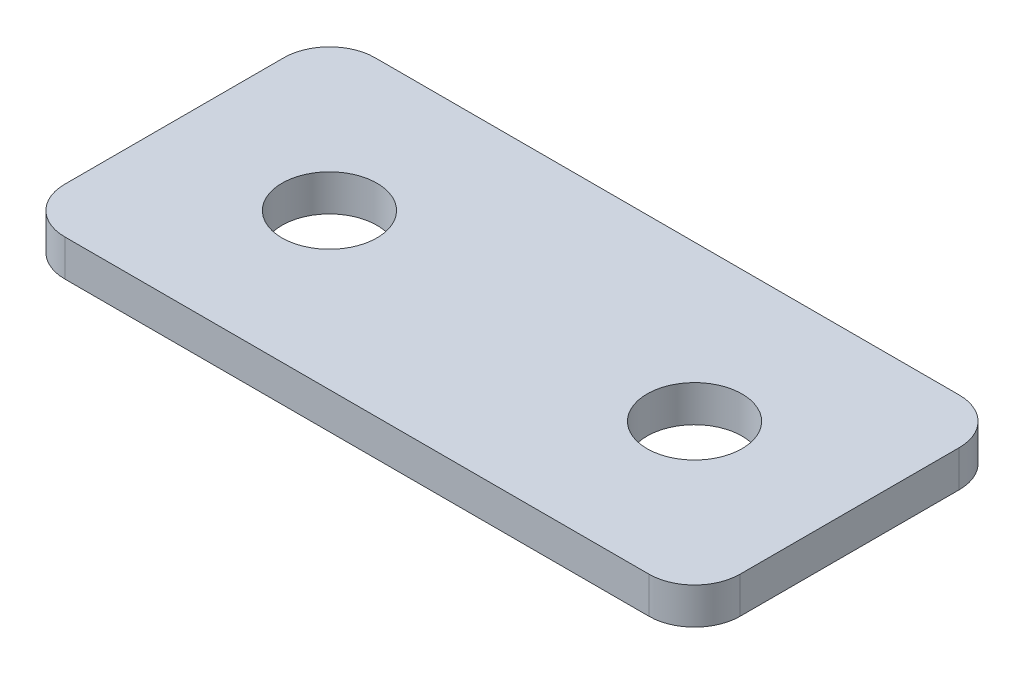
ISO-10303-21;
HEADER;
FILE_DESCRIPTION(('STEP AP214'),'2;1');
FILE_NAME('part.step','',(''),(''),'','','');
FILE_SCHEMA(('AUTOMOTIVE_DESIGN { 1 0 10303 214 1 1 1 1 }'));
ENDSEC;
DATA;
#1=APPLICATION_CONTEXT('core data for automotive mechanical design processes');
#2=APPLICATION_PROTOCOL_DEFINITION('international standard','automotive_design',2000,#1);
#3=PRODUCT_CONTEXT('',#1,'mechanical');
#4=PRODUCT('Part','Part','',(#3));
#5=PRODUCT_RELATED_PRODUCT_CATEGORY('part','',(#4));
#6=PRODUCT_DEFINITION_FORMATION('','',#4);
#7=PRODUCT_DEFINITION_CONTEXT('part definition',#1,'design');
#8=PRODUCT_DEFINITION('design','',#6,#7);
#9=PRODUCT_DEFINITION_SHAPE('','',#8);
#10=(LENGTH_UNIT() NAMED_UNIT(*) SI_UNIT(.MILLI.,.METRE.));
#11=(NAMED_UNIT(*) PLANE_ANGLE_UNIT() SI_UNIT($,.RADIAN.));
#12=(NAMED_UNIT(*) SI_UNIT($,.STERADIAN.) SOLID_ANGLE_UNIT());
#13=UNCERTAINTY_MEASURE_WITH_UNIT(LENGTH_MEASURE(1.E-05),#10,'distance_accuracy_value','');
#14=(GEOMETRIC_REPRESENTATION_CONTEXT(3) GLOBAL_UNCERTAINTY_ASSIGNED_CONTEXT((#13)) GLOBAL_UNIT_ASSIGNED_CONTEXT((#10,
#11,#12)) REPRESENTATION_CONTEXT('',''));
#15=CARTESIAN_POINT('',(0.,0.,0.));
#16=DIRECTION('',(0.,0.,1.));
#17=DIRECTION('',(1.,0.,0.));
#18=AXIS2_PLACEMENT_3D('',#15,#16,#17);
#19=CARTESIAN_POINT('',(-11.8867202723526,2.5745432277281,-1.68724203916781));
#20=DIRECTION('',(0.,-1.,0.));
#21=DIRECTION('',(0.,0.,-1.));
#22=AXIS2_PLACEMENT_3D('',#19,#20,#21);
#23=PLANE('',#22);
#24=CARTESIAN_POINT('',(8.11327972764736,2.5745432277281,-1.6872420391678));
#25=DIRECTION('',(0.,1.,0.));
#26=DIRECTION('',(0.,0.,1.));
#27=AXIS2_PLACEMENT_3D('',#24,#25,#26);
#28=CIRCLE('',#27,2.6);
#29=CARTESIAN_POINT('',(8.11327972764736,2.5745432277281,0.912757960832198));
#30=VERTEX_POINT('',#29);
#31=EDGE_CURVE('E157',#30,#30,#28,.T.);
#32=ORIENTED_EDGE('',*,*,#31,.T.);
#33=EDGE_LOOP('',(#32));
#34=FACE_BOUND('',#33,.T.);
#35=CARTESIAN_POINT('',(-11.8867202723526,2.5745432277281,-1.68724203916781));
#36=DIRECTION('',(0.,1.,0.));
#37=DIRECTION('',(0.,0.,1.));
#38=AXIS2_PLACEMENT_3D('',#35,#36,#37);
#39=CIRCLE('',#38,2.6);
#40=CARTESIAN_POINT('',(-11.8867202723526,2.5745432277281,0.912757960832188));
#41=VERTEX_POINT('',#40);
#42=EDGE_CURVE('E103',#41,#41,#39,.T.);
#43=ORIENTED_EDGE('',*,*,#42,.T.);
#44=EDGE_LOOP('',(#43));
#45=FACE_BOUND('',#44,.T.);
#46=DIRECTION('',(0.,0.,-1.));
#47=VECTOR('',#46,1.);
#48=CARTESIAN_POINT('',(16.6132797276473,2.5745432277281,6.81275796083223));
#49=LINE('',#48,#47);
#50=CARTESIAN_POINT('',(16.6132797276473,2.5745432277281,4.31275796083222));
#51=VERTEX_POINT('',#50);
#52=CARTESIAN_POINT('',(16.6132797276473,2.5745432277281,-7.68724203916785));
#53=VERTEX_POINT('',#52);
#54=EDGE_CURVE('E150',#51,#53,#49,.T.);
#55=ORIENTED_EDGE('',*,*,#54,.F.);
#56=CARTESIAN_POINT('',(14.1132797276473,2.5745432277281,4.31275796083222));
#57=DIRECTION('',(0.,-1.,0.));
#58=DIRECTION('',(0.,0.,-1.));
#59=AXIS2_PLACEMENT_3D('',#56,#57,#58);
#60=CIRCLE('',#59,2.5);
#61=CARTESIAN_POINT('',(14.1132797276473,2.5745432277281,6.81275796083223));
#62=VERTEX_POINT('',#61);
#63=EDGE_CURVE('E130',#51,#62,#60,.T.);
#64=ORIENTED_EDGE('',*,*,#63,.T.);
#65=DIRECTION('',(1.,0.,0.));
#66=VECTOR('',#65,1.);
#67=CARTESIAN_POINT('',(-3.38672027235258,2.5745432277281,6.81275796083223));
#68=LINE('',#67,#66);
#69=CARTESIAN_POINT('',(-17.8867202723527,2.5745432277281,6.81275796083223));
#70=VERTEX_POINT('',#69);
#71=EDGE_CURVE('E146',#70,#62,#68,.T.);
#72=ORIENTED_EDGE('',*,*,#71,.F.);
#73=CARTESIAN_POINT('',(-17.8867202723527,2.5745432277281,4.31275796083222));
#74=DIRECTION('',(0.,-1.,0.));
#75=DIRECTION('',(0.,0.,-1.));
#76=AXIS2_PLACEMENT_3D('',#73,#74,#75);
#77=CIRCLE('',#76,2.5);
#78=CARTESIAN_POINT('',(-20.3867202723527,2.5745432277281,4.31275796083222));
#79=VERTEX_POINT('',#78);
#80=EDGE_CURVE('E106',#70,#79,#77,.T.);
#81=ORIENTED_EDGE('',*,*,#80,.T.);
#82=DIRECTION('',(0.,0.,1.));
#83=VECTOR('',#82,1.);
#84=CARTESIAN_POINT('',(-20.3867202723527,2.5745432277281,-10.1872420391678));
#85=LINE('',#84,#83);
#86=CARTESIAN_POINT('',(-20.3867202723527,2.5745432277281,-7.68724203916785));
#87=VERTEX_POINT('',#86);
#88=EDGE_CURVE('E107',#87,#79,#85,.T.);
#89=ORIENTED_EDGE('',*,*,#88,.F.);
#90=CARTESIAN_POINT('',(-17.8867202723527,2.5745432277281,-7.68724203916785));
#91=DIRECTION('',(0.,-1.,0.));
#92=DIRECTION('',(0.,0.,-1.));
#93=AXIS2_PLACEMENT_3D('',#90,#91,#92);
#94=CIRCLE('',#93,2.5);
#95=CARTESIAN_POINT('',(-17.8867202723527,2.5745432277281,-10.1872420391678));
#96=VERTEX_POINT('',#95);
#97=EDGE_CURVE('E31',#87,#96,#94,.T.);
#98=ORIENTED_EDGE('',*,*,#97,.T.);
#99=DIRECTION('',(-1.,0.,0.));
#100=VECTOR('',#99,1.);
#101=CARTESIAN_POINT('',(16.6132797276473,2.5745432277281,-10.1872420391679));
#102=LINE('',#101,#100);
#103=CARTESIAN_POINT('',(14.1132797276473,2.5745432277281,-10.1872420391679));
#104=VERTEX_POINT('',#103);
#105=EDGE_CURVE('E111',#104,#96,#102,.T.);
#106=ORIENTED_EDGE('',*,*,#105,.F.);
#107=CARTESIAN_POINT('',(14.1132797276473,2.5745432277281,-7.68724203916785));
#108=DIRECTION('',(0.,-1.,0.));
#109=DIRECTION('',(0.,0.,-1.));
#110=AXIS2_PLACEMENT_3D('',#107,#108,#109);
#111=CIRCLE('',#110,2.5);
#112=EDGE_CURVE('E128',#104,#53,#111,.T.);
#113=ORIENTED_EDGE('',*,*,#112,.T.);
#114=EDGE_LOOP('',(#55,#64,#72,#81,#89,#98,#106,#113));
#115=FACE_BOUND('',#114,.T.);
#116=ADVANCED_FACE('F16',(#34,#45,#115),#23,.T.);
#117=CARTESIAN_POINT('',(-3.38672027235258,2.5745432277281,6.81275796083223));
#118=DIRECTION('',(0.,0.,1.));
#119=DIRECTION('',(1.,0.,0.));
#120=AXIS2_PLACEMENT_3D('',#117,#118,#119);
#121=PLANE('',#120);
#122=ORIENTED_EDGE('',*,*,#71,.T.);
#123=DIRECTION('',(0.,1.,0.));
#124=VECTOR('',#123,1.);
#125=CARTESIAN_POINT('',(14.1132797276473,2.5745432277281,6.81275796083223));
#126=LINE('',#125,#124);
#127=CARTESIAN_POINT('',(14.1132797276473,4.5745432277281,6.81275796083223));
#128=VERTEX_POINT('',#127);
#129=EDGE_CURVE('E93',#62,#128,#126,.T.);
#130=ORIENTED_EDGE('',*,*,#129,.T.);
#131=DIRECTION('',(1.,0.,0.));
#132=VECTOR('',#131,1.);
#133=CARTESIAN_POINT('',(-3.38672027235258,4.5745432277281,6.81275796083223));
#134=LINE('',#133,#132);
#135=CARTESIAN_POINT('',(-17.8867202723527,4.5745432277281,6.81275796083223));
#136=VERTEX_POINT('',#135);
#137=EDGE_CURVE('E85',#136,#128,#134,.T.);
#138=ORIENTED_EDGE('',*,*,#137,.F.);
#139=DIRECTION('',(0.,1.,0.));
#140=VECTOR('',#139,1.);
#141=CARTESIAN_POINT('',(-17.8867202723527,2.5745432277281,6.81275796083223));
#142=LINE('',#141,#140);
#143=EDGE_CURVE('E99',#136,#70,#142,.F.);
#144=ORIENTED_EDGE('',*,*,#143,.T.);
#145=EDGE_LOOP('',(#122,#130,#138,#144));
#146=FACE_BOUND('',#145,.T.);
#147=ADVANCED_FACE('F98',(#146),#121,.T.);
#148=CARTESIAN_POINT('',(-20.3867202723527,2.5745432277281,-10.1872420391678));
#149=DIRECTION('',(-1.,0.,0.));
#150=DIRECTION('',(0.,0.,1.));
#151=AXIS2_PLACEMENT_3D('',#148,#149,#150);
#152=PLANE('',#151);
#153=DIRECTION('',(0.,0.,1.));
#154=VECTOR('',#153,1.);
#155=CARTESIAN_POINT('',(-20.3867202723527,4.5745432277281,-10.1872420391678));
#156=LINE('',#155,#154);
#157=CARTESIAN_POINT('',(-20.3867202723527,4.5745432277281,-7.68724203916785));
#158=VERTEX_POINT('',#157);
#159=CARTESIAN_POINT('',(-20.3867202723527,4.5745432277281,4.31275796083222));
#160=VERTEX_POINT('',#159);
#161=EDGE_CURVE('E87',#158,#160,#156,.T.);
#162=ORIENTED_EDGE('',*,*,#161,.F.);
#163=DIRECTION('',(0.,1.,0.));
#164=VECTOR('',#163,1.);
#165=CARTESIAN_POINT('',(-20.3867202723527,2.5745432277281,-7.68724203916785));
#166=LINE('',#165,#164);
#167=EDGE_CURVE('E10',#158,#87,#166,.F.);
#168=ORIENTED_EDGE('',*,*,#167,.T.);
#169=ORIENTED_EDGE('',*,*,#88,.T.);
#170=DIRECTION('',(0.,1.,0.));
#171=VECTOR('',#170,1.);
#172=CARTESIAN_POINT('',(-20.3867202723527,2.5745432277281,4.31275796083222));
#173=LINE('',#172,#171);
#174=EDGE_CURVE('E24',#79,#160,#173,.T.);
#175=ORIENTED_EDGE('',*,*,#174,.T.);
#176=EDGE_LOOP('',(#162,#168,#169,#175));
#177=FACE_BOUND('',#176,.T.);
#178=ADVANCED_FACE('F136',(#177),#152,.T.);
#179=CARTESIAN_POINT('',(16.6132797276473,2.5745432277281,-10.1872420391679));
#180=DIRECTION('',(0.,0.,-1.));
#181=DIRECTION('',(-1.,0.,0.));
#182=AXIS2_PLACEMENT_3D('',#179,#180,#181);
#183=PLANE('',#182);
#184=DIRECTION('',(-1.,0.,0.));
#185=VECTOR('',#184,1.);
#186=CARTESIAN_POINT('',(16.6132797276473,4.5745432277281,-10.1872420391679));
#187=LINE('',#186,#185);
#188=CARTESIAN_POINT('',(14.1132797276473,4.5745432277281,-10.1872420391679));
#189=VERTEX_POINT('',#188);
#190=CARTESIAN_POINT('',(-17.8867202723527,4.5745432277281,-10.1872420391678));
#191=VERTEX_POINT('',#190);
#192=EDGE_CURVE('E144',#189,#191,#187,.T.);
#193=ORIENTED_EDGE('',*,*,#192,.F.);
#194=DIRECTION('',(0.,1.,0.));
#195=VECTOR('',#194,1.);
#196=CARTESIAN_POINT('',(14.1132797276473,2.5745432277281,-10.1872420391679));
#197=LINE('',#196,#195);
#198=EDGE_CURVE('E38',#189,#104,#197,.F.);
#199=ORIENTED_EDGE('',*,*,#198,.T.);
#200=ORIENTED_EDGE('',*,*,#105,.T.);
#201=DIRECTION('',(0.,1.,0.));
#202=VECTOR('',#201,1.);
#203=CARTESIAN_POINT('',(-17.8867202723527,2.5745432277281,-10.1872420391678));
#204=LINE('',#203,#202);
#205=EDGE_CURVE('E132',#96,#191,#204,.T.);
#206=ORIENTED_EDGE('',*,*,#205,.T.);
#207=EDGE_LOOP('',(#193,#199,#200,#206));
#208=FACE_BOUND('',#207,.T.);
#209=ADVANCED_FACE('F143',(#208),#183,.T.);
#210=CARTESIAN_POINT('',(16.6132797276473,2.5745432277281,6.81275796083223));
#211=DIRECTION('',(1.,0.,0.));
#212=DIRECTION('',(0.,0.,-1.));
#213=AXIS2_PLACEMENT_3D('',#210,#211,#212);
#214=PLANE('',#213);
#215=DIRECTION('',(0.,0.,-1.));
#216=VECTOR('',#215,1.);
#217=CARTESIAN_POINT('',(16.6132797276473,4.5745432277281,6.81275796083223));
#218=LINE('',#217,#216);
#219=CARTESIAN_POINT('',(16.6132797276473,4.5745432277281,4.31275796083222));
#220=VERTEX_POINT('',#219);
#221=CARTESIAN_POINT('',(16.6132797276473,4.5745432277281,-7.68724203916785));
#222=VERTEX_POINT('',#221);
#223=EDGE_CURVE('E102',#220,#222,#218,.T.);
#224=ORIENTED_EDGE('',*,*,#223,.F.);
#225=DIRECTION('',(0.,1.,0.));
#226=VECTOR('',#225,1.);
#227=CARTESIAN_POINT('',(16.6132797276473,2.5745432277281,4.31275796083222));
#228=LINE('',#227,#226);
#229=EDGE_CURVE('E124',#220,#51,#228,.F.);
#230=ORIENTED_EDGE('',*,*,#229,.T.);
#231=ORIENTED_EDGE('',*,*,#54,.T.);
#232=DIRECTION('',(0.,1.,0.));
#233=VECTOR('',#232,1.);
#234=CARTESIAN_POINT('',(16.6132797276473,2.5745432277281,-7.68724203916785));
#235=LINE('',#234,#233);
#236=EDGE_CURVE('E121',#53,#222,#235,.T.);
#237=ORIENTED_EDGE('',*,*,#236,.T.);
#238=EDGE_LOOP('',(#224,#230,#231,#237));
#239=FACE_BOUND('',#238,.T.);
#240=ADVANCED_FACE('F178',(#239),#214,.T.);
#241=CARTESIAN_POINT('',(-11.8867202723526,4.5745432277281,-1.68724203916781));
#242=DIRECTION('',(0.,-1.,0.));
#243=DIRECTION('',(0.,0.,-1.));
#244=AXIS2_PLACEMENT_3D('',#241,#242,#243);
#245=PLANE('',#244);
#246=CARTESIAN_POINT('',(8.11327972764736,4.5745432277281,-1.6872420391678));
#247=DIRECTION('',(0.,1.,0.));
#248=DIRECTION('',(0.,0.,1.));
#249=AXIS2_PLACEMENT_3D('',#246,#247,#248);
#250=CIRCLE('',#249,2.6);
#251=CARTESIAN_POINT('',(8.11327972764736,4.5745432277281,0.912757960832198));
#252=VERTEX_POINT('',#251);
#253=EDGE_CURVE('E160',#252,#252,#250,.T.);
#254=ORIENTED_EDGE('',*,*,#253,.F.);
#255=EDGE_LOOP('',(#254));
#256=FACE_BOUND('',#255,.T.);
#257=CARTESIAN_POINT('',(-11.8867202723526,4.5745432277281,-1.68724203916781));
#258=DIRECTION('',(0.,1.,0.));
#259=DIRECTION('',(0.,0.,1.));
#260=AXIS2_PLACEMENT_3D('',#257,#258,#259);
#261=CIRCLE('',#260,2.6);
#262=CARTESIAN_POINT('',(-11.8867202723526,4.5745432277281,0.912757960832188));
#263=VERTEX_POINT('',#262);
#264=EDGE_CURVE('E154',#263,#263,#261,.T.);
#265=ORIENTED_EDGE('',*,*,#264,.F.);
#266=EDGE_LOOP('',(#265));
#267=FACE_BOUND('',#266,.T.);
#268=ORIENTED_EDGE('',*,*,#137,.T.);
#269=CARTESIAN_POINT('',(14.1132797276473,4.5745432277281,4.31275796083222));
#270=DIRECTION('',(0.,-1.,0.));
#271=DIRECTION('',(0.,0.,-1.));
#272=AXIS2_PLACEMENT_3D('',#269,#270,#271);
#273=CIRCLE('',#272,2.5);
#274=EDGE_CURVE('E119',#128,#220,#273,.F.);
#275=ORIENTED_EDGE('',*,*,#274,.T.);
#276=ORIENTED_EDGE('',*,*,#223,.T.);
#277=CARTESIAN_POINT('',(14.1132797276473,4.5745432277281,-7.68724203916785));
#278=DIRECTION('',(0.,-1.,0.));
#279=DIRECTION('',(0.,0.,-1.));
#280=AXIS2_PLACEMENT_3D('',#277,#278,#279);
#281=CIRCLE('',#280,2.5);
#282=EDGE_CURVE('E117',#222,#189,#281,.F.);
#283=ORIENTED_EDGE('',*,*,#282,.T.);
#284=ORIENTED_EDGE('',*,*,#192,.T.);
#285=CARTESIAN_POINT('',(-17.8867202723527,4.5745432277281,-7.68724203916785));
#286=DIRECTION('',(0.,-1.,0.));
#287=DIRECTION('',(0.,0.,-1.));
#288=AXIS2_PLACEMENT_3D('',#285,#286,#287);
#289=CIRCLE('',#288,2.5);
#290=EDGE_CURVE('E92',#191,#158,#289,.F.);
#291=ORIENTED_EDGE('',*,*,#290,.T.);
#292=ORIENTED_EDGE('',*,*,#161,.T.);
#293=CARTESIAN_POINT('',(-17.8867202723527,4.5745432277281,4.31275796083222));
#294=DIRECTION('',(0.,-1.,0.));
#295=DIRECTION('',(0.,0.,-1.));
#296=AXIS2_PLACEMENT_3D('',#293,#294,#295);
#297=CIRCLE('',#296,2.5);
#298=EDGE_CURVE('E82',#160,#136,#297,.F.);
#299=ORIENTED_EDGE('',*,*,#298,.T.);
#300=EDGE_LOOP('',(#268,#275,#276,#283,#284,#291,#292,#299));
#301=FACE_BOUND('',#300,.T.);
#302=ADVANCED_FACE('F84',(#256,#267,#301),#245,.F.);
#303=CARTESIAN_POINT('',(-11.8867202723526,2.5745432277281,-1.68724203916781));
#304=DIRECTION('',(0.,1.,0.));
#305=DIRECTION('',(0.,0.,1.));
#306=AXIS2_PLACEMENT_3D('',#303,#304,#305);
#307=CYLINDRICAL_SURFACE('',#306,2.6);
#308=ORIENTED_EDGE('',*,*,#42,.F.);
#309=EDGE_LOOP('',(#308));
#310=FACE_BOUND('',#309,.T.);
#311=ORIENTED_EDGE('',*,*,#264,.T.);
#312=EDGE_LOOP('',(#311));
#313=FACE_BOUND('',#312,.T.);
#314=ADVANCED_FACE('F172',(#310,#313),#307,.F.);
#315=CARTESIAN_POINT('',(8.11327972764736,2.5745432277281,-1.6872420391678));
#316=DIRECTION('',(0.,1.,0.));
#317=DIRECTION('',(0.,0.,1.));
#318=AXIS2_PLACEMENT_3D('',#315,#316,#317);
#319=CYLINDRICAL_SURFACE('',#318,2.6);
#320=ORIENTED_EDGE('',*,*,#31,.F.);
#321=EDGE_LOOP('',(#320));
#322=FACE_BOUND('',#321,.T.);
#323=ORIENTED_EDGE('',*,*,#253,.T.);
#324=EDGE_LOOP('',(#323));
#325=FACE_BOUND('',#324,.T.);
#326=ADVANCED_FACE('F168',(#322,#325),#319,.F.);
#327=CARTESIAN_POINT('',(14.1132797276473,2.5745432277281,4.31275796083222));
#328=DIRECTION('',(0.,1.,0.));
#329=DIRECTION('',(0.,0.,1.));
#330=AXIS2_PLACEMENT_3D('',#327,#328,#329);
#331=CYLINDRICAL_SURFACE('',#330,2.5);
#332=ORIENTED_EDGE('',*,*,#63,.F.);
#333=ORIENTED_EDGE('',*,*,#229,.F.);
#334=ORIENTED_EDGE('',*,*,#274,.F.);
#335=ORIENTED_EDGE('',*,*,#129,.F.);
#336=EDGE_LOOP('',(#332,#333,#334,#335));
#337=FACE_BOUND('',#336,.T.);
#338=ADVANCED_FACE('F171',(#337),#331,.T.);
#339=CARTESIAN_POINT('',(14.1132797276473,2.5745432277281,-7.68724203916785));
#340=DIRECTION('',(0.,1.,0.));
#341=DIRECTION('',(0.,0.,1.));
#342=AXIS2_PLACEMENT_3D('',#339,#340,#341);
#343=CYLINDRICAL_SURFACE('',#342,2.5);
#344=ORIENTED_EDGE('',*,*,#112,.F.);
#345=ORIENTED_EDGE('',*,*,#198,.F.);
#346=ORIENTED_EDGE('',*,*,#282,.F.);
#347=ORIENTED_EDGE('',*,*,#236,.F.);
#348=EDGE_LOOP('',(#344,#345,#346,#347));
#349=FACE_BOUND('',#348,.T.);
#350=ADVANCED_FACE('F199',(#349),#343,.T.);
#351=CARTESIAN_POINT('',(-17.8867202723527,2.5745432277281,-7.68724203916785));
#352=DIRECTION('',(0.,1.,0.));
#353=DIRECTION('',(0.,0.,1.));
#354=AXIS2_PLACEMENT_3D('',#351,#352,#353);
#355=CYLINDRICAL_SURFACE('',#354,2.5);
#356=ORIENTED_EDGE('',*,*,#97,.F.);
#357=ORIENTED_EDGE('',*,*,#167,.F.);
#358=ORIENTED_EDGE('',*,*,#290,.F.);
#359=ORIENTED_EDGE('',*,*,#205,.F.);
#360=EDGE_LOOP('',(#356,#357,#358,#359));
#361=FACE_BOUND('',#360,.T.);
#362=ADVANCED_FACE('F141',(#361),#355,.T.);
#363=CARTESIAN_POINT('',(-17.8867202723527,2.5745432277281,4.31275796083222));
#364=DIRECTION('',(0.,1.,0.));
#365=DIRECTION('',(0.,0.,1.));
#366=AXIS2_PLACEMENT_3D('',#363,#364,#365);
#367=CYLINDRICAL_SURFACE('',#366,2.5);
#368=ORIENTED_EDGE('',*,*,#80,.F.);
#369=ORIENTED_EDGE('',*,*,#143,.F.);
#370=ORIENTED_EDGE('',*,*,#298,.F.);
#371=ORIENTED_EDGE('',*,*,#174,.F.);
#372=EDGE_LOOP('',(#368,#369,#370,#371));
#373=FACE_BOUND('',#372,.T.);
#374=ADVANCED_FACE('F18',(#373),#367,.T.);
#375=CLOSED_SHELL('',(#116,#147,#178,#209,#240,#302,#314,#326,#338,#350,#362,#374));
#376=MANIFOLD_SOLID_BREP('B1',#375);
#377=ADVANCED_BREP_SHAPE_REPRESENTATION('',(#18,#376),#14);
#378=SHAPE_DEFINITION_REPRESENTATION(#9,#377);
ENDSEC;
END-ISO-10303-21;
